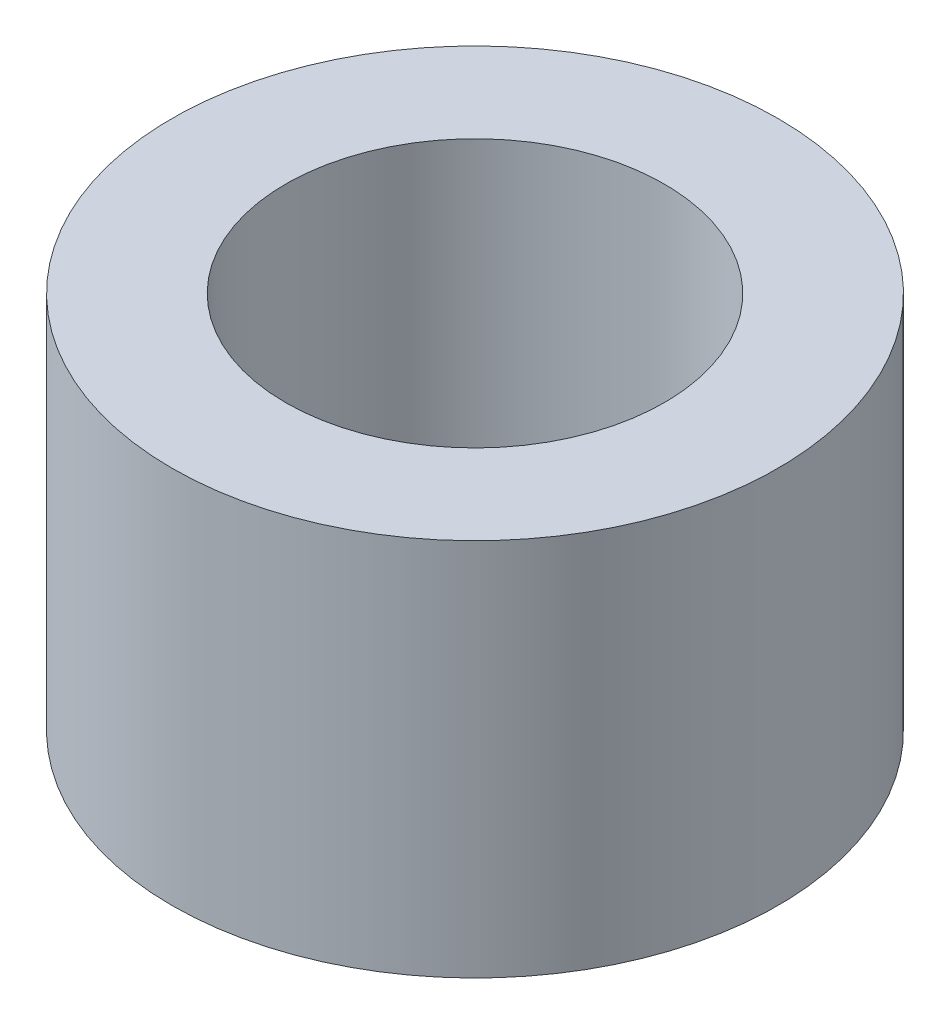
ISO-10303-21;
HEADER;
FILE_DESCRIPTION(('STEP AP214'),'2;1');
FILE_NAME('part.step','',(''),(''),'','','');
FILE_SCHEMA(('AUTOMOTIVE_DESIGN { 1 0 10303 214 1 1 1 1 }'));
ENDSEC;
DATA;
#1=APPLICATION_CONTEXT('core data for automotive mechanical design processes');
#2=APPLICATION_PROTOCOL_DEFINITION('international standard','automotive_design',2000,#1);
#3=PRODUCT_CONTEXT('',#1,'mechanical');
#4=PRODUCT('Part','Part','',(#3));
#5=PRODUCT_RELATED_PRODUCT_CATEGORY('part','',(#4));
#6=PRODUCT_DEFINITION_FORMATION('','',#4);
#7=PRODUCT_DEFINITION_CONTEXT('part definition',#1,'design');
#8=PRODUCT_DEFINITION('design','',#6,#7);
#9=PRODUCT_DEFINITION_SHAPE('','',#8);
#10=(LENGTH_UNIT() NAMED_UNIT(*) SI_UNIT(.MILLI.,.METRE.));
#11=(NAMED_UNIT(*) PLANE_ANGLE_UNIT() SI_UNIT($,.RADIAN.));
#12=(NAMED_UNIT(*) SI_UNIT($,.STERADIAN.) SOLID_ANGLE_UNIT());
#13=UNCERTAINTY_MEASURE_WITH_UNIT(LENGTH_MEASURE(1.E-05),#10,'distance_accuracy_value','');
#14=(GEOMETRIC_REPRESENTATION_CONTEXT(3) GLOBAL_UNCERTAINTY_ASSIGNED_CONTEXT((#13)) GLOBAL_UNIT_ASSIGNED_CONTEXT((#10,
#11,#12)) REPRESENTATION_CONTEXT('',''));
#15=CARTESIAN_POINT('',(0.,0.,0.));
#16=DIRECTION('',(0.,0.,1.));
#17=DIRECTION('',(1.,0.,0.));
#18=AXIS2_PLACEMENT_3D('',#15,#16,#17);
#19=CARTESIAN_POINT('',(0.,0.625,0.));
#20=DIRECTION('',(0.,1.,0.));
#21=DIRECTION('',(0.,0.,1.));
#22=AXIS2_PLACEMENT_3D('',#19,#20,#21);
#23=PLANE('',#22);
#24=CARTESIAN_POINT('',(0.,0.625,0.));
#25=DIRECTION('',(0.,1.,0.));
#26=DIRECTION('',(0.,0.,1.));
#27=AXIS2_PLACEMENT_3D('',#24,#25,#26);
#28=CIRCLE('',#27,1.);
#29=CARTESIAN_POINT('',(0.,0.625,1.));
#30=VERTEX_POINT('',#29);
#31=EDGE_CURVE('E10',#30,#30,#28,.T.);
#32=ORIENTED_EDGE('',*,*,#31,.T.);
#33=EDGE_LOOP('',(#32));
#34=FACE_BOUND('',#33,.T.);
#35=CARTESIAN_POINT('',(0.,0.625,0.));
#36=DIRECTION('',(0.,1.,0.));
#37=DIRECTION('',(0.,0.,1.));
#38=AXIS2_PLACEMENT_3D('',#35,#36,#37);
#39=CIRCLE('',#38,0.625);
#40=CARTESIAN_POINT('',(0.,0.625,0.625));
#41=VERTEX_POINT('',#40);
#42=EDGE_CURVE('E40',#41,#41,#39,.T.);
#43=ORIENTED_EDGE('',*,*,#42,.F.);
#44=EDGE_LOOP('',(#43));
#45=FACE_BOUND('',#44,.T.);
#46=ADVANCED_FACE('F29',(#34,#45),#23,.T.);
#47=CARTESIAN_POINT('',(0.,-0.625,0.));
#48=DIRECTION('',(0.,1.,0.));
#49=DIRECTION('',(0.,0.,1.));
#50=AXIS2_PLACEMENT_3D('',#47,#48,#49);
#51=PLANE('',#50);
#52=CARTESIAN_POINT('',(0.,-0.625,0.));
#53=DIRECTION('',(0.,1.,0.));
#54=DIRECTION('',(0.,0.,1.));
#55=AXIS2_PLACEMENT_3D('',#52,#53,#54);
#56=CIRCLE('',#55,1.);
#57=CARTESIAN_POINT('',(0.,-0.625,1.));
#58=VERTEX_POINT('',#57);
#59=EDGE_CURVE('E33',#58,#58,#56,.T.);
#60=ORIENTED_EDGE('',*,*,#59,.F.);
#61=EDGE_LOOP('',(#60));
#62=FACE_BOUND('',#61,.T.);
#63=CARTESIAN_POINT('',(0.,-0.625,0.));
#64=DIRECTION('',(0.,1.,0.));
#65=DIRECTION('',(0.,0.,1.));
#66=AXIS2_PLACEMENT_3D('',#63,#64,#65);
#67=CIRCLE('',#66,0.625);
#68=CARTESIAN_POINT('',(0.,-0.625,0.625));
#69=VERTEX_POINT('',#68);
#70=EDGE_CURVE('E42',#69,#69,#67,.T.);
#71=ORIENTED_EDGE('',*,*,#70,.T.);
#72=EDGE_LOOP('',(#71));
#73=FACE_BOUND('',#72,.T.);
#74=ADVANCED_FACE('F52',(#62,#73),#51,.F.);
#75=CARTESIAN_POINT('',(0.,0.625,0.));
#76=DIRECTION('',(0.,-1.,0.));
#77=DIRECTION('',(0.,0.,-1.));
#78=AXIS2_PLACEMENT_3D('',#75,#76,#77);
#79=CYLINDRICAL_SURFACE('',#78,1.);
#80=ORIENTED_EDGE('',*,*,#31,.F.);
#81=EDGE_LOOP('',(#80));
#82=FACE_BOUND('',#81,.T.);
#83=ORIENTED_EDGE('',*,*,#59,.T.);
#84=EDGE_LOOP('',(#83));
#85=FACE_BOUND('',#84,.T.);
#86=ADVANCED_FACE('F31',(#82,#85),#79,.T.);
#87=CARTESIAN_POINT('',(0.,0.625,0.));
#88=DIRECTION('',(0.,-1.,0.));
#89=DIRECTION('',(0.,0.,-1.));
#90=AXIS2_PLACEMENT_3D('',#87,#88,#89);
#91=CYLINDRICAL_SURFACE('',#90,0.625);
#92=ORIENTED_EDGE('',*,*,#42,.T.);
#93=EDGE_LOOP('',(#92));
#94=FACE_BOUND('',#93,.T.);
#95=ORIENTED_EDGE('',*,*,#70,.F.);
#96=EDGE_LOOP('',(#95));
#97=FACE_BOUND('',#96,.T.);
#98=ADVANCED_FACE('F48',(#94,#97),#91,.F.);
#99=CLOSED_SHELL('',(#46,#74,#86,#98));
#100=MANIFOLD_SOLID_BREP('B2',#99);
#101=ADVANCED_BREP_SHAPE_REPRESENTATION('',(#18,#100),#14);
#102=SHAPE_DEFINITION_REPRESENTATION(#9,#101);
ENDSEC;
END-ISO-10303-21;
